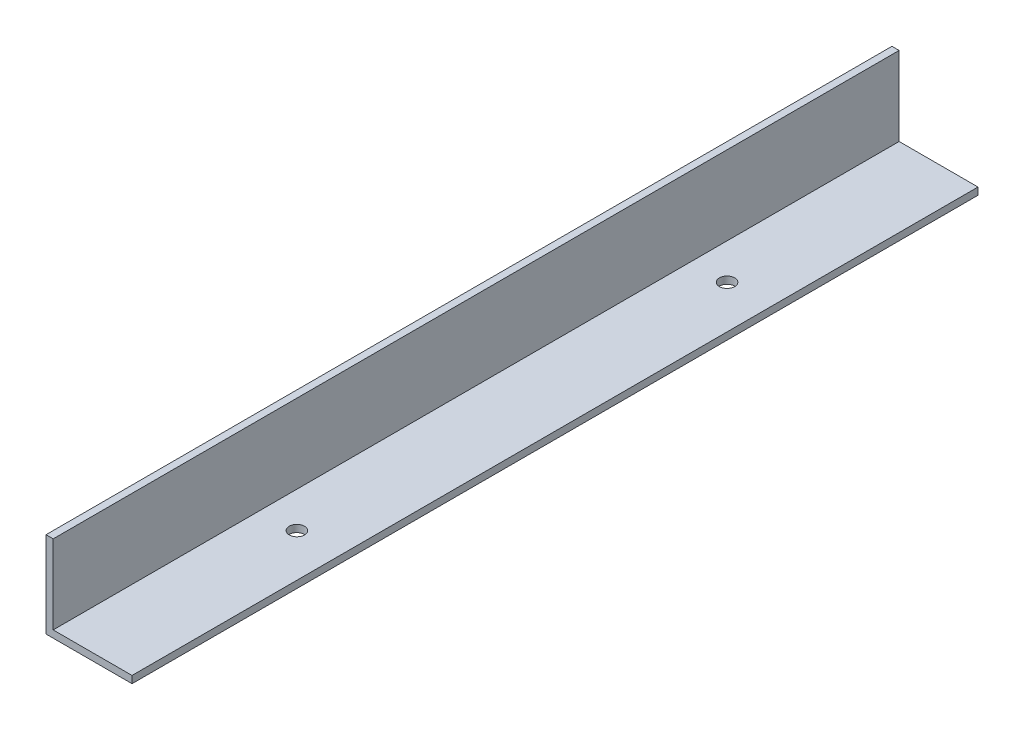
ISO-10303-21;
HEADER;
FILE_DESCRIPTION(('STEP AP214'),'2;1');
FILE_NAME('part.step','',(''),(''),'','','');
FILE_SCHEMA(('AUTOMOTIVE_DESIGN { 1 0 10303 214 1 1 1 1 }'));
ENDSEC;
DATA;
#1=APPLICATION_CONTEXT('core data for automotive mechanical design processes');
#2=APPLICATION_PROTOCOL_DEFINITION('international standard','automotive_design',2000,#1);
#3=PRODUCT_CONTEXT('',#1,'mechanical');
#4=PRODUCT('Part','Part','',(#3));
#5=PRODUCT_RELATED_PRODUCT_CATEGORY('part','',(#4));
#6=PRODUCT_DEFINITION_FORMATION('','',#4);
#7=PRODUCT_DEFINITION_CONTEXT('part definition',#1,'design');
#8=PRODUCT_DEFINITION('design','',#6,#7);
#9=PRODUCT_DEFINITION_SHAPE('','',#8);
#10=(LENGTH_UNIT() NAMED_UNIT(*) SI_UNIT(.MILLI.,.METRE.));
#11=(NAMED_UNIT(*) PLANE_ANGLE_UNIT() SI_UNIT($,.RADIAN.));
#12=(NAMED_UNIT(*) SI_UNIT($,.STERADIAN.) SOLID_ANGLE_UNIT());
#13=UNCERTAINTY_MEASURE_WITH_UNIT(LENGTH_MEASURE(1.E-05),#10,'distance_accuracy_value','');
#14=(GEOMETRIC_REPRESENTATION_CONTEXT(3) GLOBAL_UNCERTAINTY_ASSIGNED_CONTEXT((#13)) GLOBAL_UNIT_ASSIGNED_CONTEXT((#10,
#11,#12)) REPRESENTATION_CONTEXT('',''));
#15=CARTESIAN_POINT('',(0.,0.,0.));
#16=DIRECTION('',(0.,0.,1.));
#17=DIRECTION('',(1.,0.,0.));
#18=AXIS2_PLACEMENT_3D('',#15,#16,#17);
#19=CARTESIAN_POINT('',(38.1,0.,374.65));
#20=DIRECTION('',(0.,1.,0.));
#21=DIRECTION('',(-1.,0.,0.));
#22=AXIS2_PLACEMENT_3D('',#19,#20,#21);
#23=PLANE('',#22);
#24=CARTESIAN_POINT('',(19.05,0.,92.075));
#25=DIRECTION('',(0.,-1.,0.));
#26=DIRECTION('',(0.,0.,-1.));
#27=AXIS2_PLACEMENT_3D('',#24,#25,#26);
#28=CIRCLE('',#27,3.3782);
#29=CARTESIAN_POINT('',(19.05,0.,88.6968));
#30=VERTEX_POINT('',#29);
#31=EDGE_CURVE('E161',#30,#30,#28,.T.);
#32=ORIENTED_EDGE('',*,*,#31,.F.);
#33=EDGE_LOOP('',(#32));
#34=FACE_BOUND('',#33,.T.);
#35=CARTESIAN_POINT('',(19.05,0.,282.575));
#36=DIRECTION('',(0.,-1.,0.));
#37=DIRECTION('',(0.,0.,-1.));
#38=AXIS2_PLACEMENT_3D('',#35,#36,#37);
#39=CIRCLE('',#38,3.3782);
#40=CARTESIAN_POINT('',(19.05,0.,279.1968));
#41=VERTEX_POINT('',#40);
#42=EDGE_CURVE('E164',#41,#41,#39,.T.);
#43=ORIENTED_EDGE('',*,*,#42,.F.);
#44=EDGE_LOOP('',(#43));
#45=FACE_BOUND('',#44,.T.);
#46=DIRECTION('',(1.,0.,0.));
#47=VECTOR('',#46,1.);
#48=CARTESIAN_POINT('',(38.1,0.,0.));
#49=LINE('',#48,#47);
#50=CARTESIAN_POINT('',(0.,0.,0.));
#51=VERTEX_POINT('',#50);
#52=CARTESIAN_POINT('',(38.1,0.,0.));
#53=VERTEX_POINT('',#52);
#54=EDGE_CURVE('E117',#51,#53,#49,.T.);
#55=ORIENTED_EDGE('',*,*,#54,.T.);
#56=DIRECTION('',(0.,0.,-1.));
#57=VECTOR('',#56,1.);
#58=CARTESIAN_POINT('',(38.1,0.,374.65));
#59=LINE('',#58,#57);
#60=CARTESIAN_POINT('',(38.1,0.,374.65));
#61=VERTEX_POINT('',#60);
#62=EDGE_CURVE('E11',#61,#53,#59,.T.);
#63=ORIENTED_EDGE('',*,*,#62,.F.);
#64=DIRECTION('',(1.,0.,0.));
#65=VECTOR('',#64,1.);
#66=CARTESIAN_POINT('',(38.1,0.,374.65));
#67=LINE('',#66,#65);
#68=CARTESIAN_POINT('',(0.,0.,374.65));
#69=VERTEX_POINT('',#68);
#70=EDGE_CURVE('E128',#69,#61,#67,.T.);
#71=ORIENTED_EDGE('',*,*,#70,.F.);
#72=DIRECTION('',(0.,0.,-1.));
#73=VECTOR('',#72,1.);
#74=CARTESIAN_POINT('',(0.,0.,374.65));
#75=LINE('',#74,#73);
#76=EDGE_CURVE('E113',#69,#51,#75,.T.);
#77=ORIENTED_EDGE('',*,*,#76,.T.);
#78=EDGE_LOOP('',(#55,#63,#71,#77));
#79=FACE_BOUND('',#78,.T.);
#80=ADVANCED_FACE('F32',(#34,#45,#79),#23,.F.);
#81=CARTESIAN_POINT('',(38.1,3.175,374.65));
#82=DIRECTION('',(-1.,0.,0.));
#83=DIRECTION('',(0.,0.,1.));
#84=AXIS2_PLACEMENT_3D('',#81,#82,#83);
#85=PLANE('',#84);
#86=DIRECTION('',(0.,1.,0.));
#87=VECTOR('',#86,1.);
#88=CARTESIAN_POINT('',(38.1,3.175,0.));
#89=LINE('',#88,#87);
#90=CARTESIAN_POINT('',(38.1,3.175,0.));
#91=VERTEX_POINT('',#90);
#92=EDGE_CURVE('E120',#53,#91,#89,.T.);
#93=ORIENTED_EDGE('',*,*,#92,.T.);
#94=DIRECTION('',(0.,0.,-1.));
#95=VECTOR('',#94,1.);
#96=CARTESIAN_POINT('',(38.1,3.175,374.65));
#97=LINE('',#96,#95);
#98=CARTESIAN_POINT('',(38.1,3.175,374.65));
#99=VERTEX_POINT('',#98);
#100=EDGE_CURVE('E41',#99,#91,#97,.T.);
#101=ORIENTED_EDGE('',*,*,#100,.F.);
#102=DIRECTION('',(0.,1.,0.));
#103=VECTOR('',#102,1.);
#104=CARTESIAN_POINT('',(38.1,3.175,374.65));
#105=LINE('',#104,#103);
#106=EDGE_CURVE('E86',#61,#99,#105,.T.);
#107=ORIENTED_EDGE('',*,*,#106,.F.);
#108=ORIENTED_EDGE('',*,*,#62,.T.);
#109=EDGE_LOOP('',(#93,#101,#107,#108));
#110=FACE_BOUND('',#109,.T.);
#111=ADVANCED_FACE('F153',(#110),#85,.F.);
#112=CARTESIAN_POINT('',(3.17500000000001,3.175,374.65));
#113=DIRECTION('',(0.,-1.,0.));
#114=DIRECTION('',(0.,0.,-1.));
#115=AXIS2_PLACEMENT_3D('',#112,#113,#114);
#116=PLANE('',#115);
#117=CARTESIAN_POINT('',(19.05,3.175,92.075));
#118=DIRECTION('',(0.,-1.,0.));
#119=DIRECTION('',(0.,0.,-1.));
#120=AXIS2_PLACEMENT_3D('',#117,#118,#119);
#121=CIRCLE('',#120,3.37819999999999);
#122=CARTESIAN_POINT('',(19.05,3.175,88.6968));
#123=VERTEX_POINT('',#122);
#124=EDGE_CURVE('E35',#123,#123,#121,.T.);
#125=ORIENTED_EDGE('',*,*,#124,.T.);
#126=EDGE_LOOP('',(#125));
#127=FACE_BOUND('',#126,.T.);
#128=CARTESIAN_POINT('',(19.05,3.175,282.575));
#129=DIRECTION('',(0.,-1.,0.));
#130=DIRECTION('',(0.,0.,-1.));
#131=AXIS2_PLACEMENT_3D('',#128,#129,#130);
#132=CIRCLE('',#131,3.37819999999999);
#133=CARTESIAN_POINT('',(19.05,3.175,279.1968));
#134=VERTEX_POINT('',#133);
#135=EDGE_CURVE('E121',#134,#134,#132,.T.);
#136=ORIENTED_EDGE('',*,*,#135,.T.);
#137=EDGE_LOOP('',(#136));
#138=FACE_BOUND('',#137,.T.);
#139=DIRECTION('',(-1.,0.,0.));
#140=VECTOR('',#139,1.);
#141=CARTESIAN_POINT('',(3.17500000000001,3.175,0.));
#142=LINE('',#141,#140);
#143=CARTESIAN_POINT('',(3.17500000000001,3.175,0.));
#144=VERTEX_POINT('',#143);
#145=EDGE_CURVE('E123',#91,#144,#142,.T.);
#146=ORIENTED_EDGE('',*,*,#145,.T.);
#147=DIRECTION('',(0.,0.,-1.));
#148=VECTOR('',#147,1.);
#149=CARTESIAN_POINT('',(3.17500000000001,3.175,374.65));
#150=LINE('',#149,#148);
#151=CARTESIAN_POINT('',(3.17500000000001,3.175,374.65));
#152=VERTEX_POINT('',#151);
#153=EDGE_CURVE('E108',#152,#144,#150,.T.);
#154=ORIENTED_EDGE('',*,*,#153,.F.);
#155=DIRECTION('',(-1.,0.,0.));
#156=VECTOR('',#155,1.);
#157=CARTESIAN_POINT('',(3.17500000000001,3.175,374.65));
#158=LINE('',#157,#156);
#159=EDGE_CURVE('E99',#99,#152,#158,.T.);
#160=ORIENTED_EDGE('',*,*,#159,.F.);
#161=ORIENTED_EDGE('',*,*,#100,.T.);
#162=EDGE_LOOP('',(#146,#154,#160,#161));
#163=FACE_BOUND('',#162,.T.);
#164=ADVANCED_FACE('F135',(#127,#138,#163),#116,.F.);
#165=CARTESIAN_POINT('',(3.175,38.1,374.65));
#166=DIRECTION('',(-1.,0.,0.));
#167=DIRECTION('',(0.,-1.,0.));
#168=AXIS2_PLACEMENT_3D('',#165,#166,#167);
#169=PLANE('',#168);
#170=DIRECTION('',(0.,1.,0.));
#171=VECTOR('',#170,1.);
#172=CARTESIAN_POINT('',(3.175,38.1,0.));
#173=LINE('',#172,#171);
#174=CARTESIAN_POINT('',(3.175,38.1,0.));
#175=VERTEX_POINT('',#174);
#176=EDGE_CURVE('E107',#144,#175,#173,.T.);
#177=ORIENTED_EDGE('',*,*,#176,.T.);
#178=DIRECTION('',(0.,0.,-1.));
#179=VECTOR('',#178,1.);
#180=CARTESIAN_POINT('',(3.175,38.1,374.65));
#181=LINE('',#180,#179);
#182=CARTESIAN_POINT('',(3.175,38.1,374.65));
#183=VERTEX_POINT('',#182);
#184=EDGE_CURVE('E104',#183,#175,#181,.T.);
#185=ORIENTED_EDGE('',*,*,#184,.F.);
#186=DIRECTION('',(0.,1.,0.));
#187=VECTOR('',#186,1.);
#188=CARTESIAN_POINT('',(3.175,38.1,374.65));
#189=LINE('',#188,#187);
#190=EDGE_CURVE('E93',#152,#183,#189,.T.);
#191=ORIENTED_EDGE('',*,*,#190,.F.);
#192=ORIENTED_EDGE('',*,*,#153,.T.);
#193=EDGE_LOOP('',(#177,#185,#191,#192));
#194=FACE_BOUND('',#193,.T.);
#195=ADVANCED_FACE('F105',(#194),#169,.F.);
#196=CARTESIAN_POINT('',(0.,38.1,374.65));
#197=DIRECTION('',(0.,-1.,0.));
#198=DIRECTION('',(0.,0.,-1.));
#199=AXIS2_PLACEMENT_3D('',#196,#197,#198);
#200=PLANE('',#199);
#201=DIRECTION('',(-1.,0.,0.));
#202=VECTOR('',#201,1.);
#203=CARTESIAN_POINT('',(0.,38.1,0.));
#204=LINE('',#203,#202);
#205=CARTESIAN_POINT('',(0.,38.1,0.));
#206=VERTEX_POINT('',#205);
#207=EDGE_CURVE('E72',#175,#206,#204,.T.);
#208=ORIENTED_EDGE('',*,*,#207,.T.);
#209=DIRECTION('',(0.,0.,-1.));
#210=VECTOR('',#209,1.);
#211=CARTESIAN_POINT('',(0.,38.1,374.65));
#212=LINE('',#211,#210);
#213=CARTESIAN_POINT('',(0.,38.1,374.65));
#214=VERTEX_POINT('',#213);
#215=EDGE_CURVE('E109',#214,#206,#212,.T.);
#216=ORIENTED_EDGE('',*,*,#215,.F.);
#217=DIRECTION('',(-1.,0.,0.));
#218=VECTOR('',#217,1.);
#219=CARTESIAN_POINT('',(0.,38.1,374.65));
#220=LINE('',#219,#218);
#221=EDGE_CURVE('E97',#183,#214,#220,.T.);
#222=ORIENTED_EDGE('',*,*,#221,.F.);
#223=ORIENTED_EDGE('',*,*,#184,.T.);
#224=EDGE_LOOP('',(#208,#216,#222,#223));
#225=FACE_BOUND('',#224,.T.);
#226=ADVANCED_FACE('F111',(#225),#200,.F.);
#227=CARTESIAN_POINT('',(0.,0.,374.65));
#228=DIRECTION('',(1.,0.,0.));
#229=DIRECTION('',(0.,0.,-1.));
#230=AXIS2_PLACEMENT_3D('',#227,#228,#229);
#231=PLANE('',#230);
#232=DIRECTION('',(0.,-1.,0.));
#233=VECTOR('',#232,1.);
#234=CARTESIAN_POINT('',(0.,0.,0.));
#235=LINE('',#234,#233);
#236=EDGE_CURVE('E78',#206,#51,#235,.T.);
#237=ORIENTED_EDGE('',*,*,#236,.T.);
#238=ORIENTED_EDGE('',*,*,#76,.F.);
#239=DIRECTION('',(0.,-1.,0.));
#240=VECTOR('',#239,1.);
#241=CARTESIAN_POINT('',(0.,0.,374.65));
#242=LINE('',#241,#240);
#243=EDGE_CURVE('E49',#214,#69,#242,.T.);
#244=ORIENTED_EDGE('',*,*,#243,.F.);
#245=ORIENTED_EDGE('',*,*,#215,.T.);
#246=EDGE_LOOP('',(#237,#238,#244,#245));
#247=FACE_BOUND('',#246,.T.);
#248=ADVANCED_FACE('F142',(#247),#231,.F.);
#249=CARTESIAN_POINT('',(0.,0.,374.65));
#250=DIRECTION('',(0.,0.,-1.));
#251=DIRECTION('',(-1.,0.,0.));
#252=AXIS2_PLACEMENT_3D('',#249,#250,#251);
#253=PLANE('',#252);
#254=ORIENTED_EDGE('',*,*,#70,.T.);
#255=ORIENTED_EDGE('',*,*,#106,.T.);
#256=ORIENTED_EDGE('',*,*,#159,.T.);
#257=ORIENTED_EDGE('',*,*,#190,.T.);
#258=ORIENTED_EDGE('',*,*,#221,.T.);
#259=ORIENTED_EDGE('',*,*,#243,.T.);
#260=EDGE_LOOP('',(#254,#255,#256,#257,#258,#259));
#261=FACE_BOUND('',#260,.T.);
#262=ADVANCED_FACE('F95',(#261),#253,.F.);
#263=CARTESIAN_POINT('',(0.,0.,0.));
#264=DIRECTION('',(0.,0.,-1.));
#265=DIRECTION('',(-1.,0.,0.));
#266=AXIS2_PLACEMENT_3D('',#263,#264,#265);
#267=PLANE('',#266);
#268=ORIENTED_EDGE('',*,*,#54,.F.);
#269=ORIENTED_EDGE('',*,*,#236,.F.);
#270=ORIENTED_EDGE('',*,*,#207,.F.);
#271=ORIENTED_EDGE('',*,*,#176,.F.);
#272=ORIENTED_EDGE('',*,*,#145,.F.);
#273=ORIENTED_EDGE('',*,*,#92,.F.);
#274=EDGE_LOOP('',(#268,#269,#270,#271,#272,#273));
#275=FACE_BOUND('',#274,.T.);
#276=ADVANCED_FACE('F138',(#275),#267,.T.);
#277=CARTESIAN_POINT('',(19.05,0.,282.575));
#278=DIRECTION('',(0.,-1.,0.));
#279=DIRECTION('',(0.,0.,-1.));
#280=AXIS2_PLACEMENT_3D('',#277,#278,#279);
#281=CYLINDRICAL_SURFACE('',#280,3.37819999999999);
#282=ORIENTED_EDGE('',*,*,#42,.T.);
#283=EDGE_LOOP('',(#282));
#284=FACE_BOUND('',#283,.T.);
#285=ORIENTED_EDGE('',*,*,#135,.F.);
#286=EDGE_LOOP('',(#285));
#287=FACE_BOUND('',#286,.T.);
#288=ADVANCED_FACE('F177',(#284,#287),#281,.F.);
#289=CARTESIAN_POINT('',(19.05,0.,92.075));
#290=DIRECTION('',(0.,-1.,0.));
#291=DIRECTION('',(0.,0.,-1.));
#292=AXIS2_PLACEMENT_3D('',#289,#290,#291);
#293=CYLINDRICAL_SURFACE('',#292,3.37819999999999);
#294=ORIENTED_EDGE('',*,*,#31,.T.);
#295=EDGE_LOOP('',(#294));
#296=FACE_BOUND('',#295,.T.);
#297=ORIENTED_EDGE('',*,*,#124,.F.);
#298=EDGE_LOOP('',(#297));
#299=FACE_BOUND('',#298,.T.);
#300=ADVANCED_FACE('F174',(#296,#299),#293,.F.);
#301=CLOSED_SHELL('',(#80,#111,#164,#195,#226,#248,#262,#276,#288,#300));
#302=MANIFOLD_SOLID_BREP('B2',#301);
#303=ADVANCED_BREP_SHAPE_REPRESENTATION('',(#18,#302),#14);
#304=SHAPE_DEFINITION_REPRESENTATION(#9,#303);
ENDSEC;
END-ISO-10303-21;
